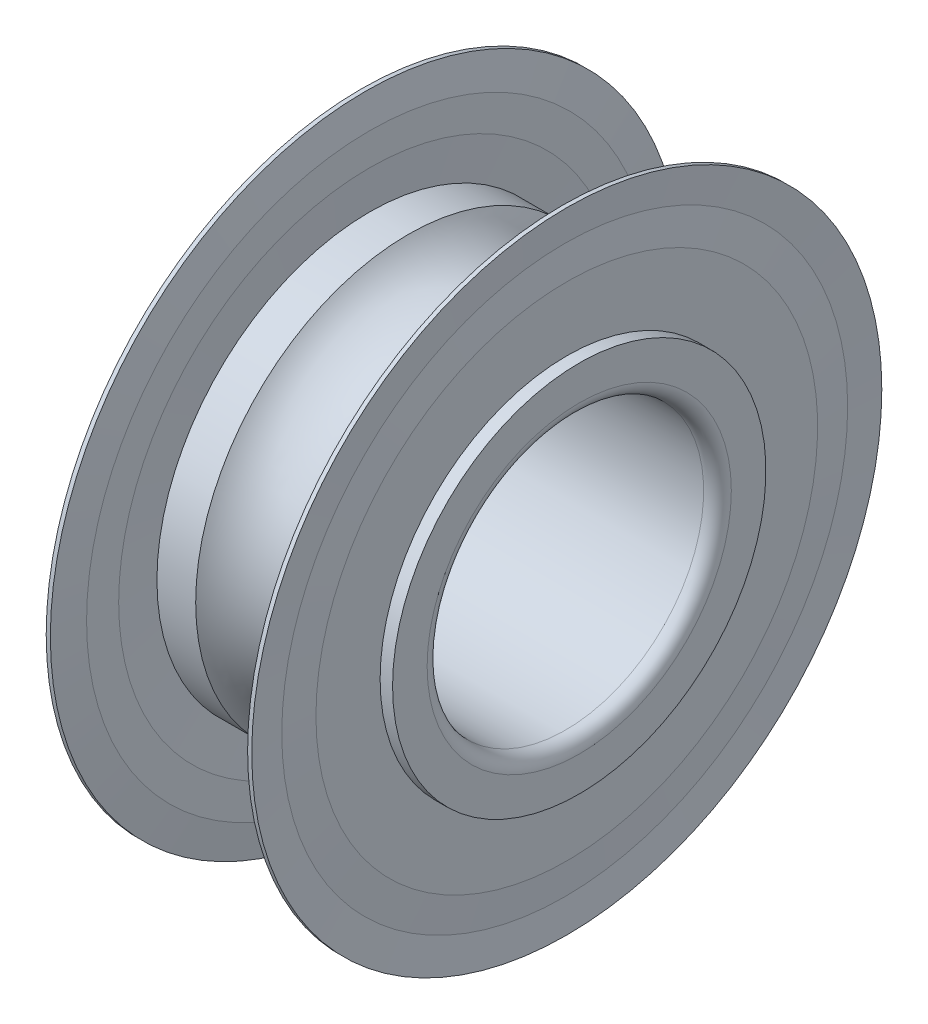
ISO-10303-21;
HEADER;
FILE_DESCRIPTION(('STEP AP214'),'2;1');
FILE_NAME('part.step','',(''),(''),'','','');
FILE_SCHEMA(('AUTOMOTIVE_DESIGN { 1 0 10303 214 1 1 1 1 }'));
ENDSEC;
DATA;
#1=APPLICATION_CONTEXT('core data for automotive mechanical design processes');
#2=APPLICATION_PROTOCOL_DEFINITION('international standard','automotive_design',2000,#1);
#3=PRODUCT_CONTEXT('',#1,'mechanical');
#4=PRODUCT('Part','Part','',(#3));
#5=PRODUCT_RELATED_PRODUCT_CATEGORY('part','',(#4));
#6=PRODUCT_DEFINITION_FORMATION('','',#4);
#7=PRODUCT_DEFINITION_CONTEXT('part definition',#1,'design');
#8=PRODUCT_DEFINITION('design','',#6,#7);
#9=PRODUCT_DEFINITION_SHAPE('','',#8);
#10=(LENGTH_UNIT() NAMED_UNIT(*) SI_UNIT(.MILLI.,.METRE.));
#11=(NAMED_UNIT(*) PLANE_ANGLE_UNIT() SI_UNIT($,.RADIAN.));
#12=(NAMED_UNIT(*) SI_UNIT($,.STERADIAN.) SOLID_ANGLE_UNIT());
#13=UNCERTAINTY_MEASURE_WITH_UNIT(LENGTH_MEASURE(1.E-05),#10,'distance_accuracy_value','');
#14=(GEOMETRIC_REPRESENTATION_CONTEXT(3) GLOBAL_UNCERTAINTY_ASSIGNED_CONTEXT((#13)) GLOBAL_UNIT_ASSIGNED_CONTEXT((#10,
#11,#12)) REPRESENTATION_CONTEXT('',''));
#15=CARTESIAN_POINT('',(0.,0.,0.));
#16=DIRECTION('',(0.,0.,1.));
#17=DIRECTION('',(1.,0.,0.));
#18=AXIS2_PLACEMENT_3D('',#15,#16,#17);
#19=CARTESIAN_POINT('',(0.,-8.32132405703635,-8.1));
#20=DIRECTION('',(-1.,0.,0.));
#21=DIRECTION('',(0.,0.,1.));
#22=AXIS2_PLACEMENT_3D('',#19,#20,#21);
#23=PLANE('',#22);
#24=CARTESIAN_POINT('',(0.,0.,0.));
#25=DIRECTION('',(-1.,0.,0.));
#26=DIRECTION('',(0.,0.,-1.));
#27=AXIS2_PLACEMENT_3D('',#24,#25,#26);
#28=CIRCLE('',#27,8.1);
#29=CARTESIAN_POINT('',(0.,0.,-8.1));
#30=VERTEX_POINT('',#29);
#31=EDGE_CURVE('E104',#30,#30,#28,.F.);
#32=ORIENTED_EDGE('',*,*,#31,.F.);
#33=EDGE_LOOP('',(#32));
#34=FACE_BOUND('',#33,.T.);
#35=CARTESIAN_POINT('',(0.,0.,0.));
#36=DIRECTION('',(1.,0.,0.));
#37=DIRECTION('',(0.,0.,1.));
#38=AXIS2_PLACEMENT_3D('',#35,#36,#37);
#39=CIRCLE('',#38,6.6);
#40=CARTESIAN_POINT('',(0.,0.,6.6));
#41=VERTEX_POINT('',#40);
#42=EDGE_CURVE('E101',#41,#41,#39,.T.);
#43=ORIENTED_EDGE('',*,*,#42,.T.);
#44=EDGE_LOOP('',(#43));
#45=FACE_BOUND('',#44,.T.);
#46=ADVANCED_FACE('F15',(#34,#45),#23,.T.);
#47=CARTESIAN_POINT('',(10.,-8.32132405703634,8.1));
#48=DIRECTION('',(1.,0.,0.));
#49=DIRECTION('',(0.,0.,-1.));
#50=AXIS2_PLACEMENT_3D('',#47,#48,#49);
#51=PLANE('',#50);
#52=CARTESIAN_POINT('',(10.,0.,0.));
#53=DIRECTION('',(1.,0.,0.));
#54=DIRECTION('',(0.,0.,1.));
#55=AXIS2_PLACEMENT_3D('',#52,#53,#54);
#56=CIRCLE('',#55,8.1);
#57=CARTESIAN_POINT('',(10.,0.,8.1));
#58=VERTEX_POINT('',#57);
#59=EDGE_CURVE('E98',#58,#58,#56,.T.);
#60=ORIENTED_EDGE('',*,*,#59,.T.);
#61=EDGE_LOOP('',(#60));
#62=FACE_BOUND('',#61,.T.);
#63=CARTESIAN_POINT('',(10.,0.,0.));
#64=DIRECTION('',(-1.,0.,0.));
#65=DIRECTION('',(0.,0.,-1.));
#66=AXIS2_PLACEMENT_3D('',#63,#64,#65);
#67=CIRCLE('',#66,6.6);
#68=CARTESIAN_POINT('',(10.,0.,-6.6));
#69=VERTEX_POINT('',#68);
#70=EDGE_CURVE('E95',#69,#69,#67,.F.);
#71=ORIENTED_EDGE('',*,*,#70,.F.);
#72=EDGE_LOOP('',(#71));
#73=FACE_BOUND('',#72,.T.);
#74=ADVANCED_FACE('F112',(#62,#73),#51,.T.);
#75=CARTESIAN_POINT('',(0.9,-9.4770635094025,9.225));
#76=DIRECTION('',(-1.,0.,0.));
#77=DIRECTION('',(0.,1.,0.));
#78=AXIS2_PLACEMENT_3D('',#75,#76,#77);
#79=PLANE('',#78);
#80=CARTESIAN_POINT('',(0.9,0.,0.));
#81=DIRECTION('',(-1.,0.,0.));
#82=DIRECTION('',(0.,0.,-1.));
#83=AXIS2_PLACEMENT_3D('',#80,#81,#82);
#84=CIRCLE('',#83,9.225);
#85=CARTESIAN_POINT('',(0.9,0.,-9.225));
#86=VERTEX_POINT('',#85);
#87=EDGE_CURVE('E92',#86,#86,#84,.T.);
#88=ORIENTED_EDGE('',*,*,#87,.T.);
#89=EDGE_LOOP('',(#88));
#90=FACE_BOUND('',#89,.T.);
#91=CARTESIAN_POINT('',(0.9,0.,0.));
#92=DIRECTION('',(1.,0.,0.));
#93=DIRECTION('',(0.,0.,1.));
#94=AXIS2_PLACEMENT_3D('',#91,#92,#93);
#95=CIRCLE('',#94,8.4333333333333);
#96=CARTESIAN_POINT('',(0.9,0.,8.4333333333333));
#97=VERTEX_POINT('',#96);
#98=EDGE_CURVE('E89',#97,#97,#95,.T.);
#99=ORIENTED_EDGE('',*,*,#98,.T.);
#100=EDGE_LOOP('',(#99));
#101=FACE_BOUND('',#100,.T.);
#102=ADVANCED_FACE('F225',(#90,#101),#79,.T.);
#103=CARTESIAN_POINT('',(9.1,-9.47706349366867,-9.225));
#104=DIRECTION('',(1.,0.,0.));
#105=DIRECTION('',(0.,1.,0.));
#106=AXIS2_PLACEMENT_3D('',#103,#104,#105);
#107=PLANE('',#106);
#108=CARTESIAN_POINT('',(9.1,0.,0.));
#109=DIRECTION('',(1.,0.,0.));
#110=DIRECTION('',(0.,-1.16854144547944E-09,1.));
#111=AXIS2_PLACEMENT_3D('',#108,#109,#110);
#112=CIRCLE('',#111,9.225);
#113=CARTESIAN_POINT('',(9.1,-1.07797948345478E-08,9.225));
#114=VERTEX_POINT('',#113);
#115=EDGE_CURVE('E86',#114,#114,#112,.T.);
#116=ORIENTED_EDGE('',*,*,#115,.T.);
#117=EDGE_LOOP('',(#116));
#118=FACE_BOUND('',#117,.T.);
#119=CARTESIAN_POINT('',(9.1,0.,0.));
#120=DIRECTION('',(-1.,0.,0.));
#121=DIRECTION('',(0.,0.,-1.));
#122=AXIS2_PLACEMENT_3D('',#119,#120,#121);
#123=CIRCLE('',#122,8.43333337429264);
#124=CARTESIAN_POINT('',(9.1,0.,-8.43333337429264));
#125=VERTEX_POINT('',#124);
#126=EDGE_CURVE('E83',#125,#125,#123,.F.);
#127=ORIENTED_EDGE('',*,*,#126,.F.);
#128=EDGE_LOOP('',(#127));
#129=FACE_BOUND('',#128,.T.);
#130=ADVANCED_FACE('F221',(#118,#129),#107,.T.);
#131=CARTESIAN_POINT('',(0.54,-11.1824212791161,-10.885));
#132=DIRECTION('',(-1.,0.,0.));
#133=DIRECTION('',(0.,0.,1.));
#134=AXIS2_PLACEMENT_3D('',#131,#132,#133);
#135=PLANE('',#134);
#136=CARTESIAN_POINT('',(0.54,0.,0.));
#137=DIRECTION('',(-1.,0.,0.));
#138=DIRECTION('',(0.,0.,-1.));
#139=AXIS2_PLACEMENT_3D('',#136,#137,#138);
#140=CIRCLE('',#139,10.885);
#141=CARTESIAN_POINT('',(0.54,0.,-10.885));
#142=VERTEX_POINT('',#141);
#143=EDGE_CURVE('E80',#142,#142,#140,.F.);
#144=ORIENTED_EDGE('',*,*,#143,.F.);
#145=EDGE_LOOP('',(#144));
#146=FACE_BOUND('',#145,.T.);
#147=CARTESIAN_POINT('',(0.54,0.,0.));
#148=DIRECTION('',(1.,0.,0.));
#149=DIRECTION('',(0.,0.,1.));
#150=AXIS2_PLACEMENT_3D('',#147,#148,#149);
#151=CIRCLE('',#150,8.1);
#152=CARTESIAN_POINT('',(0.54,0.,8.1));
#153=VERTEX_POINT('',#152);
#154=EDGE_CURVE('E77',#153,#153,#151,.T.);
#155=ORIENTED_EDGE('',*,*,#154,.T.);
#156=EDGE_LOOP('',(#155));
#157=FACE_BOUND('',#156,.T.);
#158=ADVANCED_FACE('F215',(#146,#157),#135,.T.);
#159=CARTESIAN_POINT('',(0.9,-12.5055710389415,12.2775));
#160=DIRECTION('',(1.,0.,0.));
#161=DIRECTION('',(0.,0.,-1.));
#162=AXIS2_PLACEMENT_3D('',#159,#160,#161);
#163=PLANE('',#162);
#164=CARTESIAN_POINT('',(0.9,0.,0.));
#165=DIRECTION('',(1.,0.,0.));
#166=DIRECTION('',(0.,-1.1685211679691E-09,1.));
#167=AXIS2_PLACEMENT_3D('',#164,#165,#166);
#168=CIRCLE('',#167,12.2775);
#169=CARTESIAN_POINT('',(0.9,-1.43465186397407E-08,12.2775));
#170=VERTEX_POINT('',#169);
#171=EDGE_CURVE('E74',#170,#170,#168,.T.);
#172=ORIENTED_EDGE('',*,*,#171,.T.);
#173=EDGE_LOOP('',(#172));
#174=FACE_BOUND('',#173,.T.);
#175=CARTESIAN_POINT('',(0.9,0.,0.));
#176=DIRECTION('',(-1.,0.,0.));
#177=DIRECTION('',(0.,0.,-1.));
#178=AXIS2_PLACEMENT_3D('',#175,#176,#177);
#179=CIRCLE('',#178,10.885);
#180=CARTESIAN_POINT('',(0.9,0.,-10.885));
#181=VERTEX_POINT('',#180);
#182=EDGE_CURVE('E71',#181,#181,#179,.F.);
#183=ORIENTED_EDGE('',*,*,#182,.F.);
#184=EDGE_LOOP('',(#183));
#185=FACE_BOUND('',#184,.T.);
#186=ADVANCED_FACE('F209',(#174,#185),#163,.T.);
#187=CARTESIAN_POINT('',(9.1,-12.505571060302,-12.2775));
#188=DIRECTION('',(-1.,0.,0.));
#189=DIRECTION('',(0.,0.,1.));
#190=AXIS2_PLACEMENT_3D('',#187,#188,#189);
#191=PLANE('',#190);
#192=CARTESIAN_POINT('',(9.1,0.,0.));
#193=DIRECTION('',(-1.,0.,0.));
#194=DIRECTION('',(0.,0.,-1.));
#195=AXIS2_PLACEMENT_3D('',#192,#193,#194);
#196=CIRCLE('',#195,12.2775);
#197=CARTESIAN_POINT('',(9.1,0.,-12.2775));
#198=VERTEX_POINT('',#197);
#199=EDGE_CURVE('E68',#198,#198,#196,.F.);
#200=ORIENTED_EDGE('',*,*,#199,.F.);
#201=EDGE_LOOP('',(#200));
#202=FACE_BOUND('',#201,.T.);
#203=CARTESIAN_POINT('',(9.1,0.,0.));
#204=DIRECTION('',(1.,0.,0.));
#205=DIRECTION('',(0.,-1.16843906060826E-09,1.));
#206=AXIS2_PLACEMENT_3D('',#203,#204,#205);
#207=CIRCLE('',#206,10.885);
#208=CARTESIAN_POINT('',(9.1,-1.27184591747209E-08,10.885));
#209=VERTEX_POINT('',#208);
#210=EDGE_CURVE('E65',#209,#209,#207,.T.);
#211=ORIENTED_EDGE('',*,*,#210,.T.);
#212=EDGE_LOOP('',(#211));
#213=FACE_BOUND('',#212,.T.);
#214=ADVANCED_FACE('F130',(#202,#213),#191,.T.);
#215=CARTESIAN_POINT('',(9.46,-11.1824212605506,10.885));
#216=DIRECTION('',(1.,0.,0.));
#217=DIRECTION('',(0.,0.,-1.));
#218=AXIS2_PLACEMENT_3D('',#215,#216,#217);
#219=PLANE('',#218);
#220=CARTESIAN_POINT('',(9.46,0.,0.));
#221=DIRECTION('',(1.,0.,0.));
#222=DIRECTION('',(0.,-1.16857271575309E-09,1.));
#223=AXIS2_PLACEMENT_3D('',#220,#221,#222);
#224=CIRCLE('',#223,10.885);
#225=CARTESIAN_POINT('',(9.46,-1.27199140109724E-08,10.885));
#226=VERTEX_POINT('',#225);
#227=EDGE_CURVE('E62',#226,#226,#224,.T.);
#228=ORIENTED_EDGE('',*,*,#227,.T.);
#229=EDGE_LOOP('',(#228));
#230=FACE_BOUND('',#229,.T.);
#231=CARTESIAN_POINT('',(9.46,0.,0.));
#232=DIRECTION('',(-1.,0.,0.));
#233=DIRECTION('',(0.,0.,-1.));
#234=AXIS2_PLACEMENT_3D('',#231,#232,#233);
#235=CIRCLE('',#234,8.1);
#236=CARTESIAN_POINT('',(9.46,0.,-8.1));
#237=VERTEX_POINT('',#236);
#238=EDGE_CURVE('E59',#237,#237,#235,.F.);
#239=ORIENTED_EDGE('',*,*,#238,.F.);
#240=EDGE_LOOP('',(#239));
#241=FACE_BOUND('',#240,.T.);
#242=ADVANCED_FACE('F119',(#230,#241),#219,.T.);
#243=CARTESIAN_POINT('',(0.600000000000047,0.,0.));
#244=DIRECTION('',(1.,0.,0.));
#245=DIRECTION('',(0.,0.,1.));
#246=AXIS2_PLACEMENT_3D('',#243,#244,#245);
#247=TOROIDAL_SURFACE('',#246,6.6,0.600000000000047);
#248=CARTESIAN_POINT('',(0.600000000000001,0.,0.));
#249=DIRECTION('',(1.,0.,0.));
#250=DIRECTION('',(0.,0.,1.));
#251=AXIS2_PLACEMENT_3D('',#248,#249,#250);
#252=CIRCLE('',#251,5.99999999999995);
#253=CARTESIAN_POINT('',(0.600000000000001,0.,5.99999999999995));
#254=VERTEX_POINT('',#253);
#255=EDGE_CURVE('E56',#254,#254,#252,.T.);
#256=ORIENTED_EDGE('',*,*,#255,.T.);
#257=EDGE_LOOP('',(#256));
#258=FACE_BOUND('',#257,.T.);
#259=ORIENTED_EDGE('',*,*,#42,.F.);
#260=EDGE_LOOP('',(#259));
#261=FACE_BOUND('',#260,.T.);
#262=ADVANCED_FACE('F116',(#258,#261),#247,.T.);
#263=CARTESIAN_POINT('',(50.,0.,0.));
#264=DIRECTION('',(1.,0.,0.));
#265=DIRECTION('',(0.,0.,1.));
#266=AXIS2_PLACEMENT_3D('',#263,#264,#265);
#267=CYLINDRICAL_SURFACE('',#266,6.);
#268=CARTESIAN_POINT('',(9.4,0.,0.));
#269=DIRECTION('',(1.,0.,0.));
#270=DIRECTION('',(0.,0.,1.));
#271=AXIS2_PLACEMENT_3D('',#268,#269,#270);
#272=CIRCLE('',#271,6.);
#273=CARTESIAN_POINT('',(9.4,0.,6.));
#274=VERTEX_POINT('',#273);
#275=EDGE_CURVE('E53',#274,#274,#272,.T.);
#276=ORIENTED_EDGE('',*,*,#275,.T.);
#277=EDGE_LOOP('',(#276));
#278=FACE_BOUND('',#277,.T.);
#279=ORIENTED_EDGE('',*,*,#255,.F.);
#280=EDGE_LOOP('',(#279));
#281=FACE_BOUND('',#280,.T.);
#282=ADVANCED_FACE('F118',(#278,#281),#267,.F.);
#283=CARTESIAN_POINT('',(9.3999999999999,0.,0.));
#284=DIRECTION('',(1.,0.,0.));
#285=DIRECTION('',(0.,0.,1.));
#286=AXIS2_PLACEMENT_3D('',#283,#284,#285);
#287=TOROIDAL_SURFACE('',#286,6.6000000000001,0.600000000000097);
#288=ORIENTED_EDGE('',*,*,#70,.T.);
#289=EDGE_LOOP('',(#288));
#290=FACE_BOUND('',#289,.T.);
#291=ORIENTED_EDGE('',*,*,#275,.F.);
#292=EDGE_LOOP('',(#291));
#293=FACE_BOUND('',#292,.T.);
#294=ADVANCED_FACE('F127',(#290,#293),#287,.T.);
#295=CARTESIAN_POINT('',(50.,0.,0.));
#296=DIRECTION('',(1.,0.,0.));
#297=DIRECTION('',(0.,0.,1.));
#298=AXIS2_PLACEMENT_3D('',#295,#296,#297);
#299=CYLINDRICAL_SURFACE('',#298,8.1);
#300=ORIENTED_EDGE('',*,*,#154,.F.);
#301=EDGE_LOOP('',(#300));
#302=FACE_BOUND('',#301,.T.);
#303=ORIENTED_EDGE('',*,*,#31,.T.);
#304=EDGE_LOOP('',(#303));
#305=FACE_BOUND('',#304,.T.);
#306=ADVANCED_FACE('F108',(#302,#305),#299,.T.);
#307=CARTESIAN_POINT('',(0.566666666666692,0.,0.));
#308=DIRECTION('',(1.,0.,0.));
#309=DIRECTION('',(0.,0.,1.));
#310=AXIS2_PLACEMENT_3D('',#307,#308,#309);
#311=TOROIDAL_SURFACE('',#310,8.43333333333331,0.333333333333307);
#312=ORIENTED_EDGE('',*,*,#98,.F.);
#313=EDGE_LOOP('',(#312));
#314=FACE_BOUND('',#313,.T.);
#315=CARTESIAN_POINT('',(0.722499225121288,0.,0.));
#316=DIRECTION('',(1.,0.,0.));
#317=DIRECTION('',(0.,0.,1.));
#318=AXIS2_PLACEMENT_3D('',#315,#316,#317);
#319=CIRCLE('',#318,8.13866856645985);
#320=CARTESIAN_POINT('',(0.722499225121288,0.,8.13866856645985));
#321=VERTEX_POINT('',#320);
#322=EDGE_CURVE('E50',#321,#321,#319,.T.);
#323=ORIENTED_EDGE('',*,*,#322,.T.);
#324=EDGE_LOOP('',(#323));
#325=FACE_BOUND('',#324,.T.);
#326=ADVANCED_FACE('F140',(#314,#325),#311,.F.);
#327=CARTESIAN_POINT('',(9.43333333333327,0.,0.));
#328=DIRECTION('',(1.,0.,0.));
#329=DIRECTION('',(0.,1.16852895171868E-09,1.));
#330=AXIS2_PLACEMENT_3D('',#327,#328,#329);
#331=TOROIDAL_SURFACE('',#330,8.43333333333327,0.333333333333272);
#332=CARTESIAN_POINT('',(9.27750077487871,0.,0.));
#333=DIRECTION('',(-1.,0.,0.));
#334=DIRECTION('',(0.,0.,-1.));
#335=AXIS2_PLACEMENT_3D('',#332,#333,#334);
#336=CIRCLE('',#335,8.13866856645983);
#337=CARTESIAN_POINT('',(9.27750077487871,0.,-8.13866856645983));
#338=VERTEX_POINT('',#337);
#339=EDGE_CURVE('E47',#338,#338,#336,.T.);
#340=ORIENTED_EDGE('',*,*,#339,.T.);
#341=EDGE_LOOP('',(#340));
#342=FACE_BOUND('',#341,.T.);
#343=ORIENTED_EDGE('',*,*,#126,.T.);
#344=EDGE_LOOP('',(#343));
#345=FACE_BOUND('',#344,.T.);
#346=ADVANCED_FACE('F144',(#342,#345),#331,.F.);
#347=CARTESIAN_POINT('',(50.,0.,0.));
#348=DIRECTION('',(1.,0.,0.));
#349=DIRECTION('',(0.,0.,1.));
#350=AXIS2_PLACEMENT_3D('',#347,#348,#349);
#351=CYLINDRICAL_SURFACE('',#350,8.1);
#352=ORIENTED_EDGE('',*,*,#59,.F.);
#353=EDGE_LOOP('',(#352));
#354=FACE_BOUND('',#353,.T.);
#355=ORIENTED_EDGE('',*,*,#238,.T.);
#356=EDGE_LOOP('',(#355));
#357=FACE_BOUND('',#356,.T.);
#358=ADVANCED_FACE('F148',(#354,#357),#351,.T.);
#359=CARTESIAN_POINT('',(50.,0.,0.));
#360=DIRECTION('',(1.,0.,0.));
#361=DIRECTION('',(0.,0.,1.));
#362=AXIS2_PLACEMENT_3D('',#359,#360,#361);
#363=CYLINDRICAL_SURFACE('',#362,9.225);
#364=CARTESIAN_POINT('',(7.4185481181899,0.,0.));
#365=DIRECTION('',(1.,0.,0.));
#366=DIRECTION('',(0.,0.,1.));
#367=AXIS2_PLACEMENT_3D('',#364,#365,#366);
#368=CIRCLE('',#367,9.225);
#369=CARTESIAN_POINT('',(7.4185481181899,0.,9.225));
#370=VERTEX_POINT('',#369);
#371=EDGE_CURVE('E44',#370,#370,#368,.T.);
#372=ORIENTED_EDGE('',*,*,#371,.T.);
#373=EDGE_LOOP('',(#372));
#374=FACE_BOUND('',#373,.T.);
#375=ORIENTED_EDGE('',*,*,#115,.F.);
#376=EDGE_LOOP('',(#375));
#377=FACE_BOUND('',#376,.T.);
#378=ADVANCED_FACE('F152',(#374,#377),#363,.T.);
#379=CARTESIAN_POINT('',(5.,0.,0.));
#380=DIRECTION('',(1.,0.,0.));
#381=DIRECTION('',(0.,0.,1.));
#382=AXIS2_PLACEMENT_3D('',#379,#380,#381);
#383=TOROIDAL_SURFACE('',#382,11.,2.99999999999996);
#384=ORIENTED_EDGE('',*,*,#371,.F.);
#385=EDGE_LOOP('',(#384));
#386=FACE_BOUND('',#385,.T.);
#387=CARTESIAN_POINT('',(2.58145188181012,0.,0.));
#388=DIRECTION('',(1.,0.,0.));
#389=DIRECTION('',(0.,0.,1.));
#390=AXIS2_PLACEMENT_3D('',#387,#388,#389);
#391=CIRCLE('',#390,9.22500000000001);
#392=CARTESIAN_POINT('',(2.58145188181012,0.,9.22500000000001));
#393=VERTEX_POINT('',#392);
#394=EDGE_CURVE('E41',#393,#393,#391,.T.);
#395=ORIENTED_EDGE('',*,*,#394,.T.);
#396=EDGE_LOOP('',(#395));
#397=FACE_BOUND('',#396,.T.);
#398=ADVANCED_FACE('F156',(#386,#397),#383,.F.);
#399=CARTESIAN_POINT('',(50.,0.,0.));
#400=DIRECTION('',(1.,0.,0.));
#401=DIRECTION('',(0.,0.,1.));
#402=AXIS2_PLACEMENT_3D('',#399,#400,#401);
#403=CYLINDRICAL_SURFACE('',#402,9.225);
#404=ORIENTED_EDGE('',*,*,#87,.F.);
#405=EDGE_LOOP('',(#404));
#406=FACE_BOUND('',#405,.T.);
#407=ORIENTED_EDGE('',*,*,#394,.F.);
#408=EDGE_LOOP('',(#407));
#409=FACE_BOUND('',#408,.T.);
#410=ADVANCED_FACE('F160',(#406,#409),#403,.T.);
#411=CARTESIAN_POINT('',(0.9,0.,0.));
#412=DIRECTION('',(1.,0.,0.));
#413=DIRECTION('',(0.,0.,1.));
#414=AXIS2_PLACEMENT_3D('',#411,#412,#413);
#415=CONICAL_SURFACE('',#414,10.885,1.50625414046404);
#416=ORIENTED_EDGE('',*,*,#182,.T.);
#417=EDGE_LOOP('',(#416));
#418=FACE_BOUND('',#417,.T.);
#419=ORIENTED_EDGE('',*,*,#322,.F.);
#420=EDGE_LOOP('',(#419));
#421=FACE_BOUND('',#420,.T.);
#422=ADVANCED_FACE('F164',(#418,#421),#415,.F.);
#423=CARTESIAN_POINT('',(2.,0.,0.));
#424=DIRECTION('',(1.,0.,0.));
#425=DIRECTION('',(0.,0.,1.));
#426=AXIS2_PLACEMENT_3D('',#423,#424,#425);
#427=CYLINDRICAL_SURFACE('',#426,13.67);
#428=CARTESIAN_POINT('',(0.54,0.,0.));
#429=DIRECTION('',(1.,0.,0.));
#430=DIRECTION('',(0.,0.,1.));
#431=AXIS2_PLACEMENT_3D('',#428,#429,#430);
#432=CIRCLE('',#431,13.67);
#433=CARTESIAN_POINT('',(0.54,0.,13.67));
#434=VERTEX_POINT('',#433);
#435=EDGE_CURVE('E38',#434,#434,#432,.T.);
#436=ORIENTED_EDGE('',*,*,#435,.T.);
#437=EDGE_LOOP('',(#436));
#438=FACE_BOUND('',#437,.T.);
#439=CARTESIAN_POINT('',(0.72,0.,0.));
#440=DIRECTION('',(-1.,0.,0.));
#441=DIRECTION('',(0.,0.,-1.));
#442=AXIS2_PLACEMENT_3D('',#439,#440,#441);
#443=CIRCLE('',#442,13.67);
#444=CARTESIAN_POINT('',(0.72,0.,-13.67));
#445=VERTEX_POINT('',#444);
#446=EDGE_CURVE('E35',#445,#445,#443,.F.);
#447=ORIENTED_EDGE('',*,*,#446,.F.);
#448=EDGE_LOOP('',(#447));
#449=FACE_BOUND('',#448,.T.);
#450=ADVANCED_FACE('F168',(#438,#449),#427,.T.);
#451=CARTESIAN_POINT('',(0.54,0.,0.));
#452=DIRECTION('',(-1.,0.,0.));
#453=DIRECTION('',(0.,0.,-1.));
#454=AXIS2_PLACEMENT_3D('',#451,#452,#453);
#455=CONICAL_SURFACE('',#454,13.67,1.50625414046404);
#456=ORIENTED_EDGE('',*,*,#435,.F.);
#457=EDGE_LOOP('',(#456));
#458=FACE_BOUND('',#457,.T.);
#459=CARTESIAN_POINT('',(0.63,0.,0.));
#460=DIRECTION('',(1.,0.,0.));
#461=DIRECTION('',(0.,0.,1.));
#462=AXIS2_PLACEMENT_3D('',#459,#460,#461);
#463=CIRCLE('',#462,12.2775);
#464=CARTESIAN_POINT('',(0.63,0.,12.2775));
#465=VERTEX_POINT('',#464);
#466=EDGE_CURVE('E30',#465,#465,#463,.T.);
#467=ORIENTED_EDGE('',*,*,#466,.T.);
#468=EDGE_LOOP('',(#467));
#469=FACE_BOUND('',#468,.T.);
#470=ADVANCED_FACE('F172',(#458,#469),#455,.F.);
#471=CARTESIAN_POINT('',(0.63,0.,0.));
#472=DIRECTION('',(1.,0.,0.));
#473=DIRECTION('',(0.,0.,1.));
#474=AXIS2_PLACEMENT_3D('',#471,#472,#473);
#475=CONICAL_SURFACE('',#474,12.2775,1.50625414046404);
#476=ORIENTED_EDGE('',*,*,#143,.T.);
#477=EDGE_LOOP('',(#476));
#478=FACE_BOUND('',#477,.T.);
#479=ORIENTED_EDGE('',*,*,#466,.F.);
#480=EDGE_LOOP('',(#479));
#481=FACE_BOUND('',#480,.T.);
#482=ADVANCED_FACE('F176',(#478,#481),#475,.T.);
#483=CARTESIAN_POINT('',(0.719999999999999,0.,0.));
#484=DIRECTION('',(-1.,0.,0.));
#485=DIRECTION('',(0.,0.,-1.));
#486=AXIS2_PLACEMENT_3D('',#483,#484,#485);
#487=CONICAL_SURFACE('',#486,13.67,1.44224524380117);
#488=ORIENTED_EDGE('',*,*,#446,.T.);
#489=EDGE_LOOP('',(#488));
#490=FACE_BOUND('',#489,.T.);
#491=ORIENTED_EDGE('',*,*,#171,.F.);
#492=EDGE_LOOP('',(#491));
#493=FACE_BOUND('',#492,.T.);
#494=ADVANCED_FACE('F180',(#490,#493),#487,.T.);
#495=CARTESIAN_POINT('',(9.1,0.,0.));
#496=DIRECTION('',(-1.,0.,0.));
#497=DIRECTION('',(0.,0.,-1.));
#498=AXIS2_PLACEMENT_3D('',#495,#496,#497);
#499=CONICAL_SURFACE('',#498,10.885,1.50625414046404);
#500=ORIENTED_EDGE('',*,*,#339,.F.);
#501=EDGE_LOOP('',(#500));
#502=FACE_BOUND('',#501,.T.);
#503=ORIENTED_EDGE('',*,*,#210,.F.);
#504=EDGE_LOOP('',(#503));
#505=FACE_BOUND('',#504,.T.);
#506=ADVANCED_FACE('F184',(#502,#505),#499,.F.);
#507=CARTESIAN_POINT('',(9.37,0.,0.));
#508=DIRECTION('',(-1.,0.,0.));
#509=DIRECTION('',(0.,0.,-1.));
#510=AXIS2_PLACEMENT_3D('',#507,#508,#509);
#511=CONICAL_SURFACE('',#510,12.2775,1.50625414046403);
#512=ORIENTED_EDGE('',*,*,#227,.F.);
#513=EDGE_LOOP('',(#512));
#514=FACE_BOUND('',#513,.T.);
#515=CARTESIAN_POINT('',(9.37,0.,0.));
#516=DIRECTION('',(1.,0.,0.));
#517=DIRECTION('',(0.,0.,1.));
#518=AXIS2_PLACEMENT_3D('',#515,#516,#517);
#519=CIRCLE('',#518,12.2775);
#520=CARTESIAN_POINT('',(9.37,0.,12.2775));
#521=VERTEX_POINT('',#520);
#522=EDGE_CURVE('E26',#521,#521,#519,.T.);
#523=ORIENTED_EDGE('',*,*,#522,.T.);
#524=EDGE_LOOP('',(#523));
#525=FACE_BOUND('',#524,.T.);
#526=ADVANCED_FACE('F188',(#514,#525),#511,.T.);
#527=CARTESIAN_POINT('',(9.46,0.,0.));
#528=DIRECTION('',(1.,0.,0.));
#529=DIRECTION('',(0.,0.,1.));
#530=AXIS2_PLACEMENT_3D('',#527,#528,#529);
#531=CONICAL_SURFACE('',#530,13.67,1.50625414046403);
#532=CARTESIAN_POINT('',(9.46,0.,0.));
#533=DIRECTION('',(1.,0.,0.));
#534=DIRECTION('',(0.,0.,1.));
#535=AXIS2_PLACEMENT_3D('',#532,#533,#534);
#536=CIRCLE('',#535,13.67);
#537=CARTESIAN_POINT('',(9.46,0.,13.67));
#538=VERTEX_POINT('',#537);
#539=EDGE_CURVE('E22',#538,#538,#536,.T.);
#540=ORIENTED_EDGE('',*,*,#539,.T.);
#541=EDGE_LOOP('',(#540));
#542=FACE_BOUND('',#541,.T.);
#543=ORIENTED_EDGE('',*,*,#522,.F.);
#544=EDGE_LOOP('',(#543));
#545=FACE_BOUND('',#544,.T.);
#546=ADVANCED_FACE('F192',(#542,#545),#531,.F.);
#547=CARTESIAN_POINT('',(2.,0.,0.));
#548=DIRECTION('',(1.,0.,0.));
#549=DIRECTION('',(0.,0.,1.));
#550=AXIS2_PLACEMENT_3D('',#547,#548,#549);
#551=CYLINDRICAL_SURFACE('',#550,13.67);
#552=CARTESIAN_POINT('',(9.28,0.,0.));
#553=DIRECTION('',(1.,0.,0.));
#554=DIRECTION('',(0.,0.,1.));
#555=AXIS2_PLACEMENT_3D('',#552,#553,#554);
#556=CIRCLE('',#555,13.67);
#557=CARTESIAN_POINT('',(9.28,0.,13.67));
#558=VERTEX_POINT('',#557);
#559=EDGE_CURVE('E10',#558,#558,#556,.T.);
#560=ORIENTED_EDGE('',*,*,#559,.T.);
#561=EDGE_LOOP('',(#560));
#562=FACE_BOUND('',#561,.T.);
#563=ORIENTED_EDGE('',*,*,#539,.F.);
#564=EDGE_LOOP('',(#563));
#565=FACE_BOUND('',#564,.T.);
#566=ADVANCED_FACE('F195',(#562,#565),#551,.T.);
#567=CARTESIAN_POINT('',(9.28,0.,0.));
#568=DIRECTION('',(1.,0.,0.));
#569=DIRECTION('',(0.,0.,1.));
#570=AXIS2_PLACEMENT_3D('',#567,#568,#569);
#571=CONICAL_SURFACE('',#570,13.67,1.44224524380117);
#572=ORIENTED_EDGE('',*,*,#199,.T.);
#573=EDGE_LOOP('',(#572));
#574=FACE_BOUND('',#573,.T.);
#575=ORIENTED_EDGE('',*,*,#559,.F.);
#576=EDGE_LOOP('',(#575));
#577=FACE_BOUND('',#576,.T.);
#578=ADVANCED_FACE('F17',(#574,#577),#571,.T.);
#579=CLOSED_SHELL('',(#46,#74,#102,#130,#158,#186,#214,#242,#262,#282,#294,#306,#326,#346,#358,
#378,#398,#410,#422,#450,#470,#482,#494,#506,#526,#546,#566,#578));
#580=MANIFOLD_SOLID_BREP('B1',#579);
#581=ADVANCED_BREP_SHAPE_REPRESENTATION('',(#18,#580),#14);
#582=SHAPE_DEFINITION_REPRESENTATION(#9,#581);
ENDSEC;
END-ISO-10303-21;
